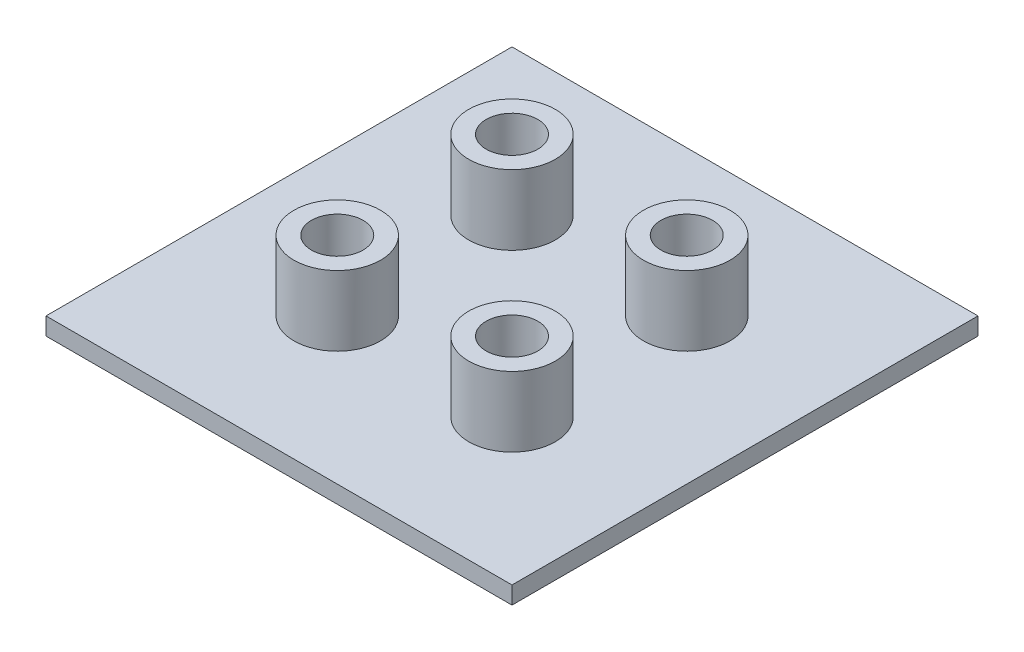
ISO-10303-21;
HEADER;
FILE_DESCRIPTION(('STEP AP214'),'2;1');
FILE_NAME('part.step','',(''),(''),'','','');
FILE_SCHEMA(('AUTOMOTIVE_DESIGN { 1 0 10303 214 1 1 1 1 }'));
ENDSEC;
DATA;
#1=APPLICATION_CONTEXT('core data for automotive mechanical design processes');
#2=APPLICATION_PROTOCOL_DEFINITION('international standard','automotive_design',2000,#1);
#3=PRODUCT_CONTEXT('',#1,'mechanical');
#4=PRODUCT('Part','Part','',(#3));
#5=PRODUCT_RELATED_PRODUCT_CATEGORY('part','',(#4));
#6=PRODUCT_DEFINITION_FORMATION('','',#4);
#7=PRODUCT_DEFINITION_CONTEXT('part definition',#1,'design');
#8=PRODUCT_DEFINITION('design','',#6,#7);
#9=PRODUCT_DEFINITION_SHAPE('','',#8);
#10=(LENGTH_UNIT() NAMED_UNIT(*) SI_UNIT(.MILLI.,.METRE.));
#11=(NAMED_UNIT(*) PLANE_ANGLE_UNIT() SI_UNIT($,.RADIAN.));
#12=(NAMED_UNIT(*) SI_UNIT($,.STERADIAN.) SOLID_ANGLE_UNIT());
#13=UNCERTAINTY_MEASURE_WITH_UNIT(LENGTH_MEASURE(1.E-05),#10,'distance_accuracy_value','');
#14=(GEOMETRIC_REPRESENTATION_CONTEXT(3) GLOBAL_UNCERTAINTY_ASSIGNED_CONTEXT((#13)) GLOBAL_UNIT_ASSIGNED_CONTEXT((#10,
#11,#12)) REPRESENTATION_CONTEXT('',''));
#15=CARTESIAN_POINT('',(0.,0.,0.));
#16=DIRECTION('',(0.,0.,1.));
#17=DIRECTION('',(1.,0.,0.));
#18=AXIS2_PLACEMENT_3D('',#15,#16,#17);
#19=CARTESIAN_POINT('',(40.,3.,40.));
#20=DIRECTION('',(-1.,0.,0.));
#21=DIRECTION('',(0.,0.,1.));
#22=AXIS2_PLACEMENT_3D('',#19,#20,#21);
#23=PLANE('',#22);
#24=DIRECTION('',(0.,0.,-1.));
#25=VECTOR('',#24,1.);
#26=CARTESIAN_POINT('',(40.,0.,40.));
#27=LINE('',#26,#25);
#28=CARTESIAN_POINT('',(40.,0.,40.));
#29=VERTEX_POINT('',#28);
#30=CARTESIAN_POINT('',(40.,0.,-40.));
#31=VERTEX_POINT('',#30);
#32=EDGE_CURVE('E99',#29,#31,#27,.T.);
#33=ORIENTED_EDGE('',*,*,#32,.T.);
#34=DIRECTION('',(0.,-1.,0.));
#35=VECTOR('',#34,1.);
#36=CARTESIAN_POINT('',(40.,3.,-40.));
#37=LINE('',#36,#35);
#38=CARTESIAN_POINT('',(40.,3.,-40.));
#39=VERTEX_POINT('',#38);
#40=EDGE_CURVE('E90',#39,#31,#37,.T.);
#41=ORIENTED_EDGE('',*,*,#40,.F.);
#42=DIRECTION('',(0.,0.,-1.));
#43=VECTOR('',#42,1.);
#44=CARTESIAN_POINT('',(40.,3.,40.));
#45=LINE('',#44,#43);
#46=CARTESIAN_POINT('',(40.,3.,40.));
#47=VERTEX_POINT('',#46);
#48=EDGE_CURVE('E84',#47,#39,#45,.T.);
#49=ORIENTED_EDGE('',*,*,#48,.F.);
#50=DIRECTION('',(0.,-1.,0.));
#51=VECTOR('',#50,1.);
#52=CARTESIAN_POINT('',(40.,3.,40.));
#53=LINE('',#52,#51);
#54=EDGE_CURVE('E95',#47,#29,#53,.T.);
#55=ORIENTED_EDGE('',*,*,#54,.T.);
#56=EDGE_LOOP('',(#33,#41,#49,#55));
#57=FACE_BOUND('',#56,.T.);
#58=ADVANCED_FACE('F32',(#57),#23,.F.);
#59=CARTESIAN_POINT('',(-40.,3.,-40.));
#60=DIRECTION('',(0.,0.,1.));
#61=DIRECTION('',(1.,0.,0.));
#62=AXIS2_PLACEMENT_3D('',#59,#60,#61);
#63=PLANE('',#62);
#64=DIRECTION('',(-1.,0.,0.));
#65=VECTOR('',#64,1.);
#66=CARTESIAN_POINT('',(-40.,0.,-40.));
#67=LINE('',#66,#65);
#68=CARTESIAN_POINT('',(-40.,0.,-40.));
#69=VERTEX_POINT('',#68);
#70=EDGE_CURVE('E89',#31,#69,#67,.T.);
#71=ORIENTED_EDGE('',*,*,#70,.T.);
#72=DIRECTION('',(0.,-1.,0.));
#73=VECTOR('',#72,1.);
#74=CARTESIAN_POINT('',(-40.,3.,-40.));
#75=LINE('',#74,#73);
#76=CARTESIAN_POINT('',(-40.,3.,-40.));
#77=VERTEX_POINT('',#76);
#78=EDGE_CURVE('E87',#77,#69,#75,.T.);
#79=ORIENTED_EDGE('',*,*,#78,.F.);
#80=DIRECTION('',(-1.,0.,0.));
#81=VECTOR('',#80,1.);
#82=CARTESIAN_POINT('',(-40.,3.,-40.));
#83=LINE('',#82,#81);
#84=EDGE_CURVE('E79',#39,#77,#83,.T.);
#85=ORIENTED_EDGE('',*,*,#84,.F.);
#86=ORIENTED_EDGE('',*,*,#40,.T.);
#87=EDGE_LOOP('',(#71,#79,#85,#86));
#88=FACE_BOUND('',#87,.T.);
#89=ADVANCED_FACE('F88',(#88),#63,.F.);
#90=CARTESIAN_POINT('',(-40.,3.,40.));
#91=DIRECTION('',(1.,0.,0.));
#92=DIRECTION('',(0.,0.,-1.));
#93=AXIS2_PLACEMENT_3D('',#90,#91,#92);
#94=PLANE('',#93);
#95=DIRECTION('',(0.,0.,1.));
#96=VECTOR('',#95,1.);
#97=CARTESIAN_POINT('',(-40.,0.,40.));
#98=LINE('',#97,#96);
#99=CARTESIAN_POINT('',(-40.,0.,40.));
#100=VERTEX_POINT('',#99);
#101=EDGE_CURVE('E65',#69,#100,#98,.T.);
#102=ORIENTED_EDGE('',*,*,#101,.T.);
#103=DIRECTION('',(0.,-1.,0.));
#104=VECTOR('',#103,1.);
#105=CARTESIAN_POINT('',(-40.,3.,40.));
#106=LINE('',#105,#104);
#107=CARTESIAN_POINT('',(-40.,3.,40.));
#108=VERTEX_POINT('',#107);
#109=EDGE_CURVE('E91',#108,#100,#106,.T.);
#110=ORIENTED_EDGE('',*,*,#109,.F.);
#111=DIRECTION('',(0.,0.,1.));
#112=VECTOR('',#111,1.);
#113=CARTESIAN_POINT('',(-40.,3.,40.));
#114=LINE('',#113,#112);
#115=EDGE_CURVE('E82',#77,#108,#114,.T.);
#116=ORIENTED_EDGE('',*,*,#115,.F.);
#117=ORIENTED_EDGE('',*,*,#78,.T.);
#118=EDGE_LOOP('',(#102,#110,#116,#117));
#119=FACE_BOUND('',#118,.T.);
#120=ADVANCED_FACE('F93',(#119),#94,.F.);
#121=CARTESIAN_POINT('',(-40.,3.,40.));
#122=DIRECTION('',(0.,0.,-1.));
#123=DIRECTION('',(-1.,0.,0.));
#124=AXIS2_PLACEMENT_3D('',#121,#122,#123);
#125=PLANE('',#124);
#126=DIRECTION('',(1.,0.,0.));
#127=VECTOR('',#126,1.);
#128=CARTESIAN_POINT('',(-40.,0.,40.));
#129=LINE('',#128,#127);
#130=EDGE_CURVE('E71',#100,#29,#129,.T.);
#131=ORIENTED_EDGE('',*,*,#130,.T.);
#132=ORIENTED_EDGE('',*,*,#54,.F.);
#133=DIRECTION('',(1.,0.,0.));
#134=VECTOR('',#133,1.);
#135=CARTESIAN_POINT('',(-40.,3.,40.));
#136=LINE('',#135,#134);
#137=EDGE_CURVE('E48',#108,#47,#136,.T.);
#138=ORIENTED_EDGE('',*,*,#137,.F.);
#139=ORIENTED_EDGE('',*,*,#109,.T.);
#140=EDGE_LOOP('',(#131,#132,#138,#139));
#141=FACE_BOUND('',#140,.T.);
#142=ADVANCED_FACE('F162',(#141),#125,.F.);
#143=CARTESIAN_POINT('',(0.,3.,0.));
#144=DIRECTION('',(0.,-1.,0.));
#145=DIRECTION('',(0.,0.,-1.));
#146=AXIS2_PLACEMENT_3D('',#143,#144,#145);
#147=PLANE('',#146);
#148=CARTESIAN_POINT('',(15.,3.,-15.));
#149=DIRECTION('',(0.,-1.,0.));
#150=DIRECTION('',(0.,0.,-1.));
#151=AXIS2_PLACEMENT_3D('',#148,#149,#150);
#152=CIRCLE('',#151,7.435);
#153=CARTESIAN_POINT('',(15.,3.,-22.435));
#154=VERTEX_POINT('',#153);
#155=EDGE_CURVE('E11',#154,#154,#152,.F.);
#156=ORIENTED_EDGE('',*,*,#155,.F.);
#157=EDGE_LOOP('',(#156));
#158=FACE_BOUND('',#157,.T.);
#159=CARTESIAN_POINT('',(15.,3.,15.));
#160=DIRECTION('',(0.,-1.,0.));
#161=DIRECTION('',(0.,0.,1.));
#162=AXIS2_PLACEMENT_3D('',#159,#160,#161);
#163=CIRCLE('',#162,7.435);
#164=CARTESIAN_POINT('',(15.,3.,22.435));
#165=VERTEX_POINT('',#164);
#166=EDGE_CURVE('E292',#165,#165,#163,.T.);
#167=ORIENTED_EDGE('',*,*,#166,.T.);
#168=EDGE_LOOP('',(#167));
#169=FACE_BOUND('',#168,.T.);
#170=CARTESIAN_POINT('',(-15.,3.,-15.));
#171=DIRECTION('',(0.,-1.,0.));
#172=DIRECTION('',(0.,0.,-1.));
#173=AXIS2_PLACEMENT_3D('',#170,#171,#172);
#174=CIRCLE('',#173,7.435);
#175=CARTESIAN_POINT('',(-15.,3.,-22.435));
#176=VERTEX_POINT('',#175);
#177=EDGE_CURVE('E283',#176,#176,#174,.T.);
#178=ORIENTED_EDGE('',*,*,#177,.T.);
#179=EDGE_LOOP('',(#178));
#180=FACE_BOUND('',#179,.T.);
#181=CARTESIAN_POINT('',(-15.,3.,15.));
#182=DIRECTION('',(0.,-1.,0.));
#183=DIRECTION('',(0.,0.,-1.));
#184=AXIS2_PLACEMENT_3D('',#181,#182,#183);
#185=CIRCLE('',#184,7.435);
#186=CARTESIAN_POINT('',(-15.,3.,7.565));
#187=VERTEX_POINT('',#186);
#188=EDGE_CURVE('E109',#187,#187,#185,.F.);
#189=ORIENTED_EDGE('',*,*,#188,.F.);
#190=EDGE_LOOP('',(#189));
#191=FACE_BOUND('',#190,.T.);
#192=ORIENTED_EDGE('',*,*,#48,.T.);
#193=ORIENTED_EDGE('',*,*,#84,.T.);
#194=ORIENTED_EDGE('',*,*,#115,.T.);
#195=ORIENTED_EDGE('',*,*,#137,.T.);
#196=EDGE_LOOP('',(#192,#193,#194,#195));
#197=FACE_BOUND('',#196,.T.);
#198=ADVANCED_FACE('F80',(#158,#169,#180,#191,#197),#147,.F.);
#199=CARTESIAN_POINT('',(0.,0.,0.));
#200=DIRECTION('',(0.,-1.,0.));
#201=DIRECTION('',(0.,0.,-1.));
#202=AXIS2_PLACEMENT_3D('',#199,#200,#201);
#203=PLANE('',#202);
#204=ORIENTED_EDGE('',*,*,#32,.F.);
#205=ORIENTED_EDGE('',*,*,#130,.F.);
#206=ORIENTED_EDGE('',*,*,#101,.F.);
#207=ORIENTED_EDGE('',*,*,#70,.F.);
#208=EDGE_LOOP('',(#204,#205,#206,#207));
#209=FACE_BOUND('',#208,.T.);
#210=ADVANCED_FACE('F152',(#209),#203,.T.);
#211=CARTESIAN_POINT('',(-15.,15.,15.));
#212=DIRECTION('',(0.,1.,0.));
#213=DIRECTION('',(0.,0.,1.));
#214=AXIS2_PLACEMENT_3D('',#211,#212,#213);
#215=PLANE('',#214);
#216=CARTESIAN_POINT('',(-15.,15.,15.));
#217=DIRECTION('',(0.,1.,0.));
#218=DIRECTION('',(0.,0.,1.));
#219=AXIS2_PLACEMENT_3D('',#216,#217,#218);
#220=CIRCLE('',#219,7.435);
#221=CARTESIAN_POINT('',(-15.,15.,22.435));
#222=VERTEX_POINT('',#221);
#223=EDGE_CURVE('E102',#222,#222,#220,.T.);
#224=ORIENTED_EDGE('',*,*,#223,.T.);
#225=EDGE_LOOP('',(#224));
#226=FACE_BOUND('',#225,.T.);
#227=CARTESIAN_POINT('',(-15.,15.,15.));
#228=DIRECTION('',(0.,1.,0.));
#229=DIRECTION('',(0.,0.,1.));
#230=AXIS2_PLACEMENT_3D('',#227,#228,#229);
#231=CIRCLE('',#230,4.435);
#232=CARTESIAN_POINT('',(-15.,15.,19.435));
#233=VERTEX_POINT('',#232);
#234=EDGE_CURVE('E274',#233,#233,#231,.T.);
#235=ORIENTED_EDGE('',*,*,#234,.F.);
#236=EDGE_LOOP('',(#235));
#237=FACE_BOUND('',#236,.T.);
#238=ADVANCED_FACE('F154',(#226,#237),#215,.T.);
#239=CARTESIAN_POINT('',(-15.,15.,15.));
#240=DIRECTION('',(0.,-1.,0.));
#241=DIRECTION('',(0.,0.,-1.));
#242=AXIS2_PLACEMENT_3D('',#239,#240,#241);
#243=CYLINDRICAL_SURFACE('',#242,7.435);
#244=ORIENTED_EDGE('',*,*,#223,.F.);
#245=EDGE_LOOP('',(#244));
#246=FACE_BOUND('',#245,.T.);
#247=ORIENTED_EDGE('',*,*,#188,.T.);
#248=EDGE_LOOP('',(#247));
#249=FACE_BOUND('',#248,.T.);
#250=ADVANCED_FACE('F159',(#246,#249),#243,.T.);
#251=CARTESIAN_POINT('',(-15.,15.,15.));
#252=DIRECTION('',(0.,-1.,0.));
#253=DIRECTION('',(0.,0.,-1.));
#254=AXIS2_PLACEMENT_3D('',#251,#252,#253);
#255=CYLINDRICAL_SURFACE('',#254,4.435);
#256=ORIENTED_EDGE('',*,*,#234,.T.);
#257=EDGE_LOOP('',(#256));
#258=FACE_BOUND('',#257,.T.);
#259=CARTESIAN_POINT('',(-15.,3.,15.));
#260=DIRECTION('',(0.,1.,0.));
#261=DIRECTION('',(0.,0.,1.));
#262=AXIS2_PLACEMENT_3D('',#259,#260,#261);
#263=CIRCLE('',#262,4.435);
#264=CARTESIAN_POINT('',(-15.,3.,19.435));
#265=VERTEX_POINT('',#264);
#266=EDGE_CURVE('E277',#265,#265,#263,.T.);
#267=ORIENTED_EDGE('',*,*,#266,.F.);
#268=EDGE_LOOP('',(#267));
#269=FACE_BOUND('',#268,.T.);
#270=ADVANCED_FACE('F262',(#258,#269),#255,.F.);
#271=ORIENTED_EDGE('',*,*,#266,.T.);
#272=EDGE_LOOP('',(#271));
#273=FACE_BOUND('',#272,.T.);
#274=ADVANCED_FACE('F141',(#273),#147,.F.);
#275=CARTESIAN_POINT('',(-15.,15.,-15.));
#276=DIRECTION('',(0.,-1.,0.));
#277=DIRECTION('',(0.,0.,-1.));
#278=AXIS2_PLACEMENT_3D('',#275,#276,#277);
#279=CYLINDRICAL_SURFACE('',#278,7.435);
#280=CARTESIAN_POINT('',(-15.,15.,-15.));
#281=DIRECTION('',(0.,-1.,0.));
#282=DIRECTION('',(0.,0.,-1.));
#283=AXIS2_PLACEMENT_3D('',#280,#281,#282);
#284=CIRCLE('',#283,7.435);
#285=CARTESIAN_POINT('',(-15.,15.,-22.435));
#286=VERTEX_POINT('',#285);
#287=EDGE_CURVE('E281',#286,#286,#284,.T.);
#288=ORIENTED_EDGE('',*,*,#287,.T.);
#289=EDGE_LOOP('',(#288));
#290=FACE_BOUND('',#289,.T.);
#291=ORIENTED_EDGE('',*,*,#177,.F.);
#292=EDGE_LOOP('',(#291));
#293=FACE_BOUND('',#292,.T.);
#294=ADVANCED_FACE('F257',(#290,#293),#279,.T.);
#295=CARTESIAN_POINT('',(-15.,15.,-15.));
#296=DIRECTION('',(0.,1.,0.));
#297=DIRECTION('',(0.,0.,-1.));
#298=AXIS2_PLACEMENT_3D('',#295,#296,#297);
#299=PLANE('',#298);
#300=CARTESIAN_POINT('',(-15.,15.,-15.));
#301=DIRECTION('',(0.,-1.,0.));
#302=DIRECTION('',(0.,0.,-1.));
#303=AXIS2_PLACEMENT_3D('',#300,#301,#302);
#304=CIRCLE('',#303,4.435);
#305=CARTESIAN_POINT('',(-15.,15.,-19.435));
#306=VERTEX_POINT('',#305);
#307=EDGE_CURVE('E286',#306,#306,#304,.T.);
#308=ORIENTED_EDGE('',*,*,#307,.T.);
#309=EDGE_LOOP('',(#308));
#310=FACE_BOUND('',#309,.T.);
#311=ORIENTED_EDGE('',*,*,#287,.F.);
#312=EDGE_LOOP('',(#311));
#313=FACE_BOUND('',#312,.T.);
#314=ADVANCED_FACE('F253',(#310,#313),#299,.T.);
#315=CARTESIAN_POINT('',(-15.,15.,-15.));
#316=DIRECTION('',(0.,-1.,0.));
#317=DIRECTION('',(0.,0.,-1.));
#318=AXIS2_PLACEMENT_3D('',#315,#316,#317);
#319=CYLINDRICAL_SURFACE('',#318,4.435);
#320=ORIENTED_EDGE('',*,*,#307,.F.);
#321=EDGE_LOOP('',(#320));
#322=FACE_BOUND('',#321,.T.);
#323=CARTESIAN_POINT('',(-15.,3.,-15.));
#324=DIRECTION('',(0.,-1.,0.));
#325=DIRECTION('',(0.,0.,-1.));
#326=AXIS2_PLACEMENT_3D('',#323,#324,#325);
#327=CIRCLE('',#326,4.435);
#328=CARTESIAN_POINT('',(-15.,3.,-19.435));
#329=VERTEX_POINT('',#328);
#330=EDGE_CURVE('E112',#329,#329,#327,.T.);
#331=ORIENTED_EDGE('',*,*,#330,.T.);
#332=EDGE_LOOP('',(#331));
#333=FACE_BOUND('',#332,.T.);
#334=ADVANCED_FACE('F139',(#322,#333),#319,.F.);
#335=ORIENTED_EDGE('',*,*,#330,.F.);
#336=EDGE_LOOP('',(#335));
#337=FACE_BOUND('',#336,.T.);
#338=ADVANCED_FACE('F123',(#337),#147,.F.);
#339=CARTESIAN_POINT('',(15.,15.,15.));
#340=DIRECTION('',(0.,-1.,0.));
#341=DIRECTION('',(0.,0.,-1.));
#342=AXIS2_PLACEMENT_3D('',#339,#340,#341);
#343=CYLINDRICAL_SURFACE('',#342,7.435);
#344=CARTESIAN_POINT('',(15.,15.,15.));
#345=DIRECTION('',(0.,-1.,0.));
#346=DIRECTION('',(0.,0.,1.));
#347=AXIS2_PLACEMENT_3D('',#344,#345,#346);
#348=CIRCLE('',#347,7.435);
#349=CARTESIAN_POINT('',(15.,15.,22.435));
#350=VERTEX_POINT('',#349);
#351=EDGE_CURVE('E291',#350,#350,#348,.T.);
#352=ORIENTED_EDGE('',*,*,#351,.T.);
#353=EDGE_LOOP('',(#352));
#354=FACE_BOUND('',#353,.T.);
#355=ORIENTED_EDGE('',*,*,#166,.F.);
#356=EDGE_LOOP('',(#355));
#357=FACE_BOUND('',#356,.T.);
#358=ADVANCED_FACE('F138',(#354,#357),#343,.T.);
#359=CARTESIAN_POINT('',(15.,15.,15.));
#360=DIRECTION('',(0.,1.,0.));
#361=DIRECTION('',(0.,0.,1.));
#362=AXIS2_PLACEMENT_3D('',#359,#360,#361);
#363=PLANE('',#362);
#364=CARTESIAN_POINT('',(15.,15.,15.));
#365=DIRECTION('',(0.,-1.,0.));
#366=DIRECTION('',(0.,0.,1.));
#367=AXIS2_PLACEMENT_3D('',#364,#365,#366);
#368=CIRCLE('',#367,4.435);
#369=CARTESIAN_POINT('',(15.,15.,19.435));
#370=VERTEX_POINT('',#369);
#371=EDGE_CURVE('E295',#370,#370,#368,.T.);
#372=ORIENTED_EDGE('',*,*,#371,.T.);
#373=EDGE_LOOP('',(#372));
#374=FACE_BOUND('',#373,.T.);
#375=ORIENTED_EDGE('',*,*,#351,.F.);
#376=EDGE_LOOP('',(#375));
#377=FACE_BOUND('',#376,.T.);
#378=ADVANCED_FACE('F132',(#374,#377),#363,.T.);
#379=CARTESIAN_POINT('',(15.,15.,15.));
#380=DIRECTION('',(0.,-1.,0.));
#381=DIRECTION('',(0.,0.,-1.));
#382=AXIS2_PLACEMENT_3D('',#379,#380,#381);
#383=CYLINDRICAL_SURFACE('',#382,4.435);
#384=ORIENTED_EDGE('',*,*,#371,.F.);
#385=EDGE_LOOP('',(#384));
#386=FACE_BOUND('',#385,.T.);
#387=CARTESIAN_POINT('',(15.,3.,15.));
#388=DIRECTION('',(0.,-1.,0.));
#389=DIRECTION('',(0.,0.,-1.));
#390=AXIS2_PLACEMENT_3D('',#387,#388,#389);
#391=CIRCLE('',#390,4.435);
#392=CARTESIAN_POINT('',(15.,3.,10.565));
#393=VERTEX_POINT('',#392);
#394=EDGE_CURVE('E40',#393,#393,#391,.T.);
#395=ORIENTED_EDGE('',*,*,#394,.T.);
#396=EDGE_LOOP('',(#395));
#397=FACE_BOUND('',#396,.T.);
#398=ADVANCED_FACE('F117',(#386,#397),#383,.F.);
#399=ORIENTED_EDGE('',*,*,#394,.F.);
#400=EDGE_LOOP('',(#399));
#401=FACE_BOUND('',#400,.T.);
#402=ADVANCED_FACE('F119',(#401),#147,.F.);
#403=CARTESIAN_POINT('',(15.,15.,-15.));
#404=DIRECTION('',(0.,1.,0.));
#405=DIRECTION('',(0.,0.,-1.));
#406=AXIS2_PLACEMENT_3D('',#403,#404,#405);
#407=PLANE('',#406);
#408=CARTESIAN_POINT('',(15.,15.,-15.));
#409=DIRECTION('',(0.,1.,0.));
#410=DIRECTION('',(0.,0.,-1.));
#411=AXIS2_PLACEMENT_3D('',#408,#409,#410);
#412=CIRCLE('',#411,7.435);
#413=CARTESIAN_POINT('',(15.,15.,-22.435));
#414=VERTEX_POINT('',#413);
#415=EDGE_CURVE('E300',#414,#414,#412,.T.);
#416=ORIENTED_EDGE('',*,*,#415,.T.);
#417=EDGE_LOOP('',(#416));
#418=FACE_BOUND('',#417,.T.);
#419=CARTESIAN_POINT('',(15.,15.,-15.));
#420=DIRECTION('',(0.,1.,0.));
#421=DIRECTION('',(0.,0.,-1.));
#422=AXIS2_PLACEMENT_3D('',#419,#420,#421);
#423=CIRCLE('',#422,4.435);
#424=CARTESIAN_POINT('',(15.,15.,-19.435));
#425=VERTEX_POINT('',#424);
#426=EDGE_CURVE('E303',#425,#425,#423,.T.);
#427=ORIENTED_EDGE('',*,*,#426,.F.);
#428=EDGE_LOOP('',(#427));
#429=FACE_BOUND('',#428,.T.);
#430=ADVANCED_FACE('F121',(#418,#429),#407,.T.);
#431=CARTESIAN_POINT('',(15.,15.,-15.));
#432=DIRECTION('',(0.,-1.,0.));
#433=DIRECTION('',(0.,0.,-1.));
#434=AXIS2_PLACEMENT_3D('',#431,#432,#433);
#435=CYLINDRICAL_SURFACE('',#434,7.435);
#436=ORIENTED_EDGE('',*,*,#415,.F.);
#437=EDGE_LOOP('',(#436));
#438=FACE_BOUND('',#437,.T.);
#439=ORIENTED_EDGE('',*,*,#155,.T.);
#440=EDGE_LOOP('',(#439));
#441=FACE_BOUND('',#440,.T.);
#442=ADVANCED_FACE('F129',(#438,#441),#435,.T.);
#443=CARTESIAN_POINT('',(15.,15.,-15.));
#444=DIRECTION('',(0.,-1.,0.));
#445=DIRECTION('',(0.,0.,-1.));
#446=AXIS2_PLACEMENT_3D('',#443,#444,#445);
#447=CYLINDRICAL_SURFACE('',#446,4.435);
#448=ORIENTED_EDGE('',*,*,#426,.T.);
#449=EDGE_LOOP('',(#448));
#450=FACE_BOUND('',#449,.T.);
#451=CARTESIAN_POINT('',(15.,3.,-15.));
#452=DIRECTION('',(0.,1.,0.));
#453=DIRECTION('',(0.,0.,-1.));
#454=AXIS2_PLACEMENT_3D('',#451,#452,#453);
#455=CIRCLE('',#454,4.435);
#456=CARTESIAN_POINT('',(15.,3.,-19.435));
#457=VERTEX_POINT('',#456);
#458=EDGE_CURVE('E304',#457,#457,#455,.T.);
#459=ORIENTED_EDGE('',*,*,#458,.F.);
#460=EDGE_LOOP('',(#459));
#461=FACE_BOUND('',#460,.T.);
#462=ADVANCED_FACE('F143',(#450,#461),#447,.F.);
#463=ORIENTED_EDGE('',*,*,#458,.T.);
#464=EDGE_LOOP('',(#463));
#465=FACE_BOUND('',#464,.T.);
#466=ADVANCED_FACE('F124',(#465),#147,.F.);
#467=CLOSED_SHELL('',(#58,#89,#120,#142,#198,#210,#238,#250,#270,#274,#294,#314,#334,#338,#358,
#378,#398,#402,#430,#442,#462,#466));
#468=MANIFOLD_SOLID_BREP('B2',#467);
#469=ADVANCED_BREP_SHAPE_REPRESENTATION('',(#18,#468),#14);
#470=SHAPE_DEFINITION_REPRESENTATION(#9,#469);
ENDSEC;
END-ISO-10303-21;
